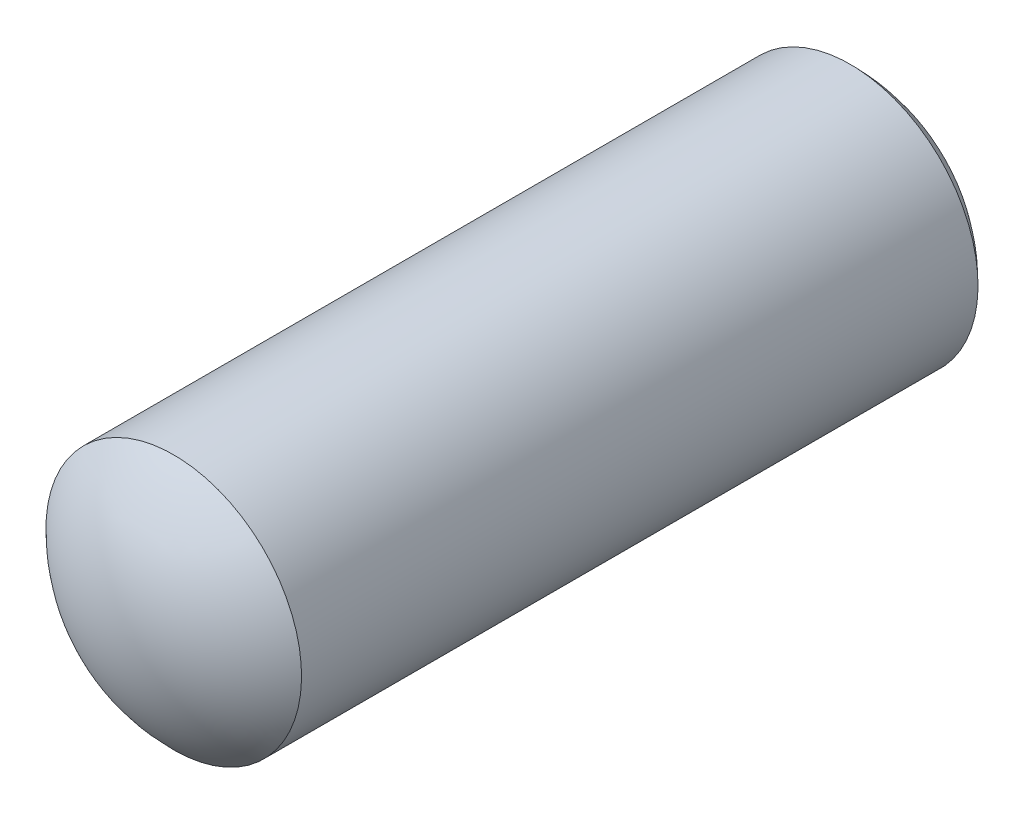
ISO-10303-21;
HEADER;
FILE_DESCRIPTION(('STEP AP214'),'2;1');
FILE_NAME('part.step','',(''),(''),'','','');
FILE_SCHEMA(('AUTOMOTIVE_DESIGN { 1 0 10303 214 1 1 1 1 }'));
ENDSEC;
DATA;
#1=APPLICATION_CONTEXT('core data for automotive mechanical design processes');
#2=APPLICATION_PROTOCOL_DEFINITION('international standard','automotive_design',2000,#1);
#3=PRODUCT_CONTEXT('',#1,'mechanical');
#4=PRODUCT('Part','Part','',(#3));
#5=PRODUCT_RELATED_PRODUCT_CATEGORY('part','',(#4));
#6=PRODUCT_DEFINITION_FORMATION('','',#4);
#7=PRODUCT_DEFINITION_CONTEXT('part definition',#1,'design');
#8=PRODUCT_DEFINITION('design','',#6,#7);
#9=PRODUCT_DEFINITION_SHAPE('','',#8);
#10=(LENGTH_UNIT() NAMED_UNIT(*) SI_UNIT(.MILLI.,.METRE.));
#11=(NAMED_UNIT(*) PLANE_ANGLE_UNIT() SI_UNIT($,.RADIAN.));
#12=(NAMED_UNIT(*) SI_UNIT($,.STERADIAN.) SOLID_ANGLE_UNIT());
#13=UNCERTAINTY_MEASURE_WITH_UNIT(LENGTH_MEASURE(1.E-05),#10,'distance_accuracy_value','');
#14=(GEOMETRIC_REPRESENTATION_CONTEXT(3) GLOBAL_UNCERTAINTY_ASSIGNED_CONTEXT((#13)) GLOBAL_UNIT_ASSIGNED_CONTEXT((#10,
#11,#12)) REPRESENTATION_CONTEXT('',''));
#15=CARTESIAN_POINT('',(0.,0.,0.));
#16=DIRECTION('',(0.,0.,1.));
#17=DIRECTION('',(1.,0.,0.));
#18=AXIS2_PLACEMENT_3D('',#15,#16,#17);
#19=CARTESIAN_POINT('',(4.93334745928237,-7.67643848708455,7.875));
#20=DIRECTION('',(-0.841253532831181,-0.540640817455597,0.));
#21=DIRECTION('',(0.,0.,1.));
#22=AXIS2_PLACEMENT_3D('',#19,#20,#21);
#23=SPHERICAL_SURFACE('',#22,1.575);
#24=CARTESIAN_POINT('',(4.93334745928237,-7.67643848708455,7.875));
#25=DIRECTION('',(0.,0.,1.));
#26=DIRECTION('',(-0.540640817455598,0.841253532831181,0.));
#27=AXIS2_PLACEMENT_3D('',#24,#25,#26);
#28=SPHERICAL_SURFACE('',#27,1.575);
#29=CARTESIAN_POINT('',(4.93334745928237,-7.67643848708455,8.97727038425245));
#30=DIRECTION('',(0.,0.,1.));
#31=DIRECTION('',(-0.540640817455598,0.841253532831181,0.));
#32=AXIS2_PLACEMENT_3D('',#29,#30,#31);
#33=CIRCLE('',#32,1.125);
#34=CARTESIAN_POINT('',(4.32512653964482,-6.73002826264947,8.97727038425245));
#35=VERTEX_POINT('',#34);
#36=EDGE_CURVE('E11',#35,#35,#33,.T.);
#37=ORIENTED_EDGE('',*,*,#36,.T.);
#38=EDGE_LOOP('',(#37));
#39=FACE_BOUND('',#38,.T.);
#40=ADVANCED_FACE('F17',(#39),#28,.T.);
#41=CARTESIAN_POINT('',(4.93334745928237,-7.67643848708455,6.));
#42=DIRECTION('',(0.,0.,1.));
#43=DIRECTION('',(-0.540640817455598,0.841253532831181,0.));
#44=AXIS2_PLACEMENT_3D('',#41,#42,#43);
#45=CYLINDRICAL_SURFACE('',#44,1.125);
#46=CARTESIAN_POINT('',(4.93334745928237,-7.67643848708455,3.02272961574759));
#47=DIRECTION('',(0.,0.,1.));
#48=DIRECTION('',(-0.540640817455598,0.841253532831181,0.));
#49=AXIS2_PLACEMENT_3D('',#46,#47,#48);
#50=CIRCLE('',#49,1.125);
#51=CARTESIAN_POINT('',(4.32512653964482,-6.73002826264947,3.02272961574759));
#52=VERTEX_POINT('',#51);
#53=EDGE_CURVE('E26',#52,#52,#50,.T.);
#54=ORIENTED_EDGE('',*,*,#53,.T.);
#55=EDGE_LOOP('',(#54));
#56=FACE_BOUND('',#55,.T.);
#57=ORIENTED_EDGE('',*,*,#36,.F.);
#58=EDGE_LOOP('',(#57));
#59=FACE_BOUND('',#58,.T.);
#60=ADVANCED_FACE('F39',(#56,#59),#45,.T.);
#61=CARTESIAN_POINT('',(4.93334745928237,-7.67643848708455,4.125));
#62=DIRECTION('',(-0.841253532831181,-0.540640817455598,0.));
#63=DIRECTION('',(0.,0.,-1.));
#64=AXIS2_PLACEMENT_3D('',#61,#62,#63);
#65=SPHERICAL_SURFACE('',#64,1.575);
#66=CARTESIAN_POINT('',(4.93334745928237,-7.67643848708455,4.125));
#67=DIRECTION('',(0.,0.,1.));
#68=DIRECTION('',(-0.540640817455598,0.841253532831181,0.));
#69=AXIS2_PLACEMENT_3D('',#66,#67,#68);
#70=SPHERICAL_SURFACE('',#69,1.575);
#71=ORIENTED_EDGE('',*,*,#53,.F.);
#72=EDGE_LOOP('',(#71));
#73=FACE_BOUND('',#72,.T.);
#74=ADVANCED_FACE('F52',(#73),#70,.T.);
#75=CLOSED_SHELL('',(#40,#60,#74));
#76=MANIFOLD_SOLID_BREP('B1',#75);
#77=ADVANCED_BREP_SHAPE_REPRESENTATION('',(#18,#76),#14);
#78=SHAPE_DEFINITION_REPRESENTATION(#9,#77);
ENDSEC;
END-ISO-10303-21;
